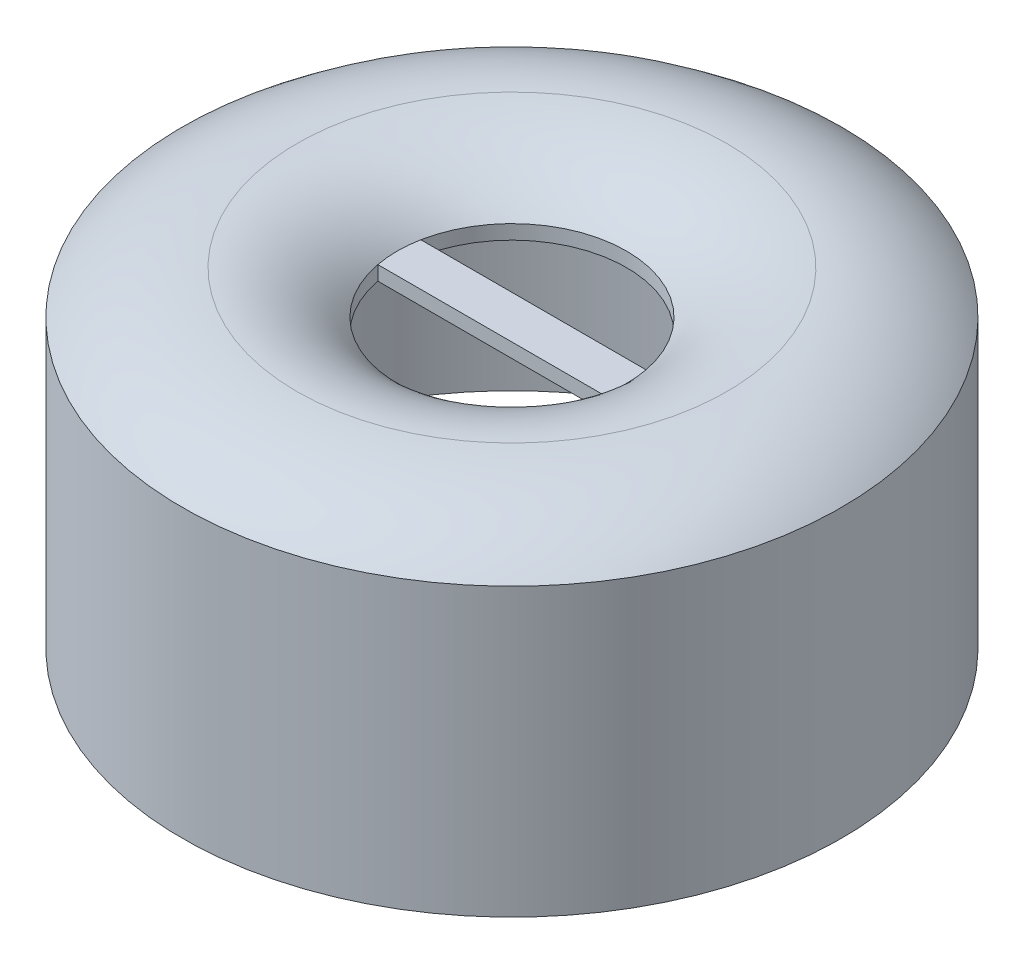
ISO-10303-21;
HEADER;
FILE_DESCRIPTION(('STEP AP214'),'2;1');
FILE_NAME('part.step','',(''),(''),'','','');
FILE_SCHEMA(('AUTOMOTIVE_DESIGN { 1 0 10303 214 1 1 1 1 }'));
ENDSEC;
DATA;
#1=APPLICATION_CONTEXT('core data for automotive mechanical design processes');
#2=APPLICATION_PROTOCOL_DEFINITION('international standard','automotive_design',2000,#1);
#3=PRODUCT_CONTEXT('',#1,'mechanical');
#4=PRODUCT('Part','Part','',(#3));
#5=PRODUCT_RELATED_PRODUCT_CATEGORY('part','',(#4));
#6=PRODUCT_DEFINITION_FORMATION('','',#4);
#7=PRODUCT_DEFINITION_CONTEXT('part definition',#1,'design');
#8=PRODUCT_DEFINITION('design','',#6,#7);
#9=PRODUCT_DEFINITION_SHAPE('','',#8);
#10=(LENGTH_UNIT() NAMED_UNIT(*) SI_UNIT(.MILLI.,.METRE.));
#11=(NAMED_UNIT(*) PLANE_ANGLE_UNIT() SI_UNIT($,.RADIAN.));
#12=(NAMED_UNIT(*) SI_UNIT($,.STERADIAN.) SOLID_ANGLE_UNIT());
#13=UNCERTAINTY_MEASURE_WITH_UNIT(LENGTH_MEASURE(1.E-05),#10,'distance_accuracy_value','');
#14=(GEOMETRIC_REPRESENTATION_CONTEXT(3) GLOBAL_UNCERTAINTY_ASSIGNED_CONTEXT((#13)) GLOBAL_UNIT_ASSIGNED_CONTEXT((#10,
#11,#12)) REPRESENTATION_CONTEXT('',''));
#15=CARTESIAN_POINT('',(0.,0.,0.));
#16=DIRECTION('',(0.,0.,1.));
#17=DIRECTION('',(1.,0.,0.));
#18=AXIS2_PLACEMENT_3D('',#15,#16,#17);
#19=CARTESIAN_POINT('',(-11.2696793002915,9.5,0.));
#20=DIRECTION('',(0.,-1.,0.));
#21=DIRECTION('',(0.,0.,-1.));
#22=AXIS2_PLACEMENT_3D('',#19,#20,#21);
#23=PLANE('',#22);
#24=CARTESIAN_POINT('',(-11.2696793002915,9.5,0.));
#25=DIRECTION('',(0.,-1.,0.));
#26=DIRECTION('',(0.,0.,-1.));
#27=AXIS2_PLACEMENT_3D('',#24,#25,#26);
#28=CIRCLE('',#27,4.);
#29=CARTESIAN_POINT('',(-7.34062088891612,9.5,-0.75));
#30=VERTEX_POINT('',#29);
#31=CARTESIAN_POINT('',(-15.198737711667,9.5,-0.75));
#32=VERTEX_POINT('',#31);
#33=EDGE_CURVE('E62',#30,#32,#28,.F.);
#34=ORIENTED_EDGE('',*,*,#33,.T.);
#35=DIRECTION('',(1.,0.,0.));
#36=VECTOR('',#35,1.);
#37=CARTESIAN_POINT('',(-15.198737711667,9.5,-0.75));
#38=LINE('',#37,#36);
#39=EDGE_CURVE('E95',#32,#30,#38,.T.);
#40=ORIENTED_EDGE('',*,*,#39,.T.);
#41=EDGE_LOOP('',(#34,#40));
#42=FACE_BOUND('',#41,.T.);
#43=CARTESIAN_POINT('',(-11.2696793002915,9.5,0.));
#44=DIRECTION('',(0.,-1.,0.));
#45=DIRECTION('',(0.,0.,-1.));
#46=AXIS2_PLACEMENT_3D('',#43,#44,#45);
#47=CIRCLE('',#46,4.);
#48=CARTESIAN_POINT('',(-15.198737711667,9.5,0.75));
#49=VERTEX_POINT('',#48);
#50=CARTESIAN_POINT('',(-7.34062088891611,9.5,0.75));
#51=VERTEX_POINT('',#50);
#52=EDGE_CURVE('E68',#49,#51,#47,.F.);
#53=ORIENTED_EDGE('',*,*,#52,.T.);
#54=DIRECTION('',(-1.,0.,0.));
#55=VECTOR('',#54,1.);
#56=CARTESIAN_POINT('',(-15.198737711667,9.5,0.75));
#57=LINE('',#56,#55);
#58=EDGE_CURVE('E13',#51,#49,#57,.T.);
#59=ORIENTED_EDGE('',*,*,#58,.T.);
#60=EDGE_LOOP('',(#53,#59));
#61=FACE_BOUND('',#60,.T.);
#62=CARTESIAN_POINT('',(-11.2696793002915,9.5,0.));
#63=DIRECTION('',(0.,-1.,0.));
#64=DIRECTION('',(0.,0.,-1.));
#65=AXIS2_PLACEMENT_3D('',#62,#63,#64);
#66=CIRCLE('',#65,5.);
#67=CARTESIAN_POINT('',(-11.2696793002915,9.5,-5.));
#68=VERTEX_POINT('',#67);
#69=EDGE_CURVE('E165',#68,#68,#66,.F.);
#70=ORIENTED_EDGE('',*,*,#69,.F.);
#71=EDGE_LOOP('',(#70));
#72=FACE_BOUND('',#71,.T.);
#73=ADVANCED_FACE('F48',(#42,#61,#72),#23,.T.);
#74=CARTESIAN_POINT('',(-11.2696793002915,0.,0.));
#75=DIRECTION('',(0.,1.,0.));
#76=DIRECTION('',(0.,0.,1.));
#77=AXIS2_PLACEMENT_3D('',#74,#75,#76);
#78=CYLINDRICAL_SURFACE('',#77,4.);
#79=ORIENTED_EDGE('',*,*,#33,.F.);
#80=DIRECTION('',(0.,1.,0.));
#81=VECTOR('',#80,1.);
#82=CARTESIAN_POINT('',(-7.34062088891611,0.,-0.75));
#83=LINE('',#82,#81);
#84=CARTESIAN_POINT('',(-7.34062088891611,10.,-0.75));
#85=VERTEX_POINT('',#84);
#86=EDGE_CURVE('E114',#30,#85,#83,.T.);
#87=ORIENTED_EDGE('',*,*,#86,.T.);
#88=CARTESIAN_POINT('',(-11.2696793002915,10.,0.));
#89=DIRECTION('',(0.,1.,0.));
#90=DIRECTION('',(0.,0.,1.));
#91=AXIS2_PLACEMENT_3D('',#88,#89,#90);
#92=CIRCLE('',#91,4.);
#93=CARTESIAN_POINT('',(-15.198737711667,10.,-0.75));
#94=VERTEX_POINT('',#93);
#95=EDGE_CURVE('E102',#85,#94,#92,.T.);
#96=ORIENTED_EDGE('',*,*,#95,.T.);
#97=DIRECTION('',(0.,1.,0.));
#98=VECTOR('',#97,1.);
#99=CARTESIAN_POINT('',(-15.198737711667,0.,-0.75));
#100=LINE('',#99,#98);
#101=EDGE_CURVE('E113',#32,#94,#100,.T.);
#102=ORIENTED_EDGE('',*,*,#101,.F.);
#103=EDGE_LOOP('',(#79,#87,#96,#102));
#104=FACE_BOUND('',#103,.T.);
#105=ADVANCED_FACE('F187',(#104),#78,.F.);
#106=CARTESIAN_POINT('',(-15.198737711667,0.,-0.75));
#107=DIRECTION('',(0.,0.,1.));
#108=DIRECTION('',(1.,0.,0.));
#109=AXIS2_PLACEMENT_3D('',#106,#107,#108);
#110=PLANE('',#109);
#111=ORIENTED_EDGE('',*,*,#39,.F.);
#112=ORIENTED_EDGE('',*,*,#101,.T.);
#113=DIRECTION('',(1.,0.,0.));
#114=VECTOR('',#113,1.);
#115=CARTESIAN_POINT('',(-15.198737711667,10.,-0.75));
#116=LINE('',#115,#114);
#117=EDGE_CURVE('E105',#94,#85,#116,.T.);
#118=ORIENTED_EDGE('',*,*,#117,.T.);
#119=ORIENTED_EDGE('',*,*,#86,.F.);
#120=EDGE_LOOP('',(#111,#112,#118,#119));
#121=FACE_BOUND('',#120,.T.);
#122=ADVANCED_FACE('F193',(#121),#110,.F.);
#123=CARTESIAN_POINT('',(-11.2696793002915,0.,0.));
#124=DIRECTION('',(0.,1.,0.));
#125=DIRECTION('',(0.,0.,1.));
#126=AXIS2_PLACEMENT_3D('',#123,#124,#125);
#127=CYLINDRICAL_SURFACE('',#126,4.);
#128=ORIENTED_EDGE('',*,*,#52,.F.);
#129=DIRECTION('',(0.,1.,0.));
#130=VECTOR('',#129,1.);
#131=CARTESIAN_POINT('',(-15.198737711667,0.,0.75));
#132=LINE('',#131,#130);
#133=CARTESIAN_POINT('',(-15.198737711667,10.,0.75));
#134=VERTEX_POINT('',#133);
#135=EDGE_CURVE('E92',#49,#134,#132,.T.);
#136=ORIENTED_EDGE('',*,*,#135,.T.);
#137=CARTESIAN_POINT('',(-11.2696793002915,10.,0.));
#138=DIRECTION('',(0.,1.,0.));
#139=DIRECTION('',(0.,0.,1.));
#140=AXIS2_PLACEMENT_3D('',#137,#138,#139);
#141=CIRCLE('',#140,4.);
#142=CARTESIAN_POINT('',(-7.34062088891612,10.,0.75));
#143=VERTEX_POINT('',#142);
#144=EDGE_CURVE('E150',#134,#143,#141,.T.);
#145=ORIENTED_EDGE('',*,*,#144,.T.);
#146=DIRECTION('',(0.,1.,0.));
#147=VECTOR('',#146,1.);
#148=CARTESIAN_POINT('',(-7.34062088891611,0.,0.75));
#149=LINE('',#148,#147);
#150=EDGE_CURVE('E94',#51,#143,#149,.T.);
#151=ORIENTED_EDGE('',*,*,#150,.F.);
#152=EDGE_LOOP('',(#128,#136,#145,#151));
#153=FACE_BOUND('',#152,.T.);
#154=ADVANCED_FACE('F90',(#153),#127,.F.);
#155=CARTESIAN_POINT('',(-15.198737711667,0.,0.75));
#156=DIRECTION('',(0.,0.,-1.));
#157=DIRECTION('',(-1.,0.,0.));
#158=AXIS2_PLACEMENT_3D('',#155,#156,#157);
#159=PLANE('',#158);
#160=ORIENTED_EDGE('',*,*,#58,.F.);
#161=ORIENTED_EDGE('',*,*,#150,.T.);
#162=DIRECTION('',(-1.,0.,0.));
#163=VECTOR('',#162,1.);
#164=CARTESIAN_POINT('',(-15.198737711667,10.,0.75));
#165=LINE('',#164,#163);
#166=EDGE_CURVE('E100',#143,#134,#165,.T.);
#167=ORIENTED_EDGE('',*,*,#166,.T.);
#168=ORIENTED_EDGE('',*,*,#135,.F.);
#169=EDGE_LOOP('',(#160,#161,#167,#168));
#170=FACE_BOUND('',#169,.T.);
#171=ADVANCED_FACE('F98',(#170),#159,.F.);
#172=CARTESIAN_POINT('',(-22.7696793002915,0.,0.));
#173=DIRECTION('',(0.,1.,0.));
#174=DIRECTION('',(0.,0.,1.));
#175=AXIS2_PLACEMENT_3D('',#172,#173,#174);
#176=PLANE('',#175);
#177=CARTESIAN_POINT('',(-11.2696793002915,0.,0.));
#178=DIRECTION('',(0.,-1.,0.));
#179=DIRECTION('',(0.,0.,-1.));
#180=AXIS2_PLACEMENT_3D('',#177,#178,#179);
#181=CIRCLE('',#180,11.);
#182=CARTESIAN_POINT('',(-11.2696793002915,0.,-11.));
#183=VERTEX_POINT('',#182);
#184=EDGE_CURVE('E156',#183,#183,#181,.T.);
#185=ORIENTED_EDGE('',*,*,#184,.F.);
#186=EDGE_LOOP('',(#185));
#187=FACE_BOUND('',#186,.T.);
#188=CARTESIAN_POINT('',(-11.2696793002915,0.,0.));
#189=DIRECTION('',(0.,-1.,0.));
#190=DIRECTION('',(0.,0.,-1.));
#191=AXIS2_PLACEMENT_3D('',#188,#189,#190);
#192=CIRCLE('',#191,11.5);
#193=CARTESIAN_POINT('',(-11.2696793002915,0.,-11.5));
#194=VERTEX_POINT('',#193);
#195=EDGE_CURVE('E56',#194,#194,#192,.T.);
#196=ORIENTED_EDGE('',*,*,#195,.T.);
#197=EDGE_LOOP('',(#196));
#198=FACE_BOUND('',#197,.T.);
#199=ADVANCED_FACE('F50',(#187,#198),#176,.F.);
#200=CARTESIAN_POINT('',(-11.2696793002915,0.,0.));
#201=DIRECTION('',(0.,-1.,0.));
#202=DIRECTION('',(0.,0.,-1.));
#203=AXIS2_PLACEMENT_3D('',#200,#201,#202);
#204=CYLINDRICAL_SURFACE('',#203,11.5);
#205=ORIENTED_EDGE('',*,*,#195,.F.);
#206=EDGE_LOOP('',(#205));
#207=FACE_BOUND('',#206,.T.);
#208=CARTESIAN_POINT('',(-11.2696793002915,10.,0.));
#209=DIRECTION('',(0.,-1.,0.));
#210=DIRECTION('',(0.,0.,-1.));
#211=AXIS2_PLACEMENT_3D('',#208,#209,#210);
#212=CIRCLE('',#211,11.5);
#213=CARTESIAN_POINT('',(-11.2696793002915,10.,-11.5));
#214=VERTEX_POINT('',#213);
#215=EDGE_CURVE('E124',#214,#214,#212,.T.);
#216=ORIENTED_EDGE('',*,*,#215,.T.);
#217=EDGE_LOOP('',(#216));
#218=FACE_BOUND('',#217,.T.);
#219=ADVANCED_FACE('F130',(#207,#218),#204,.T.);
#220=CARTESIAN_POINT('',(-11.2696793002915,5.41666666666666,0.));
#221=DIRECTION('',(0.,-1.,0.));
#222=DIRECTION('',(0.,0.,-1.));
#223=AXIS2_PLACEMENT_3D('',#220,#221,#222);
#224=TOROIDAL_SURFACE('',#223,7.5,6.08333333333334);
#225=ORIENTED_EDGE('',*,*,#215,.F.);
#226=EDGE_LOOP('',(#225));
#227=FACE_BOUND('',#226,.T.);
#228=CARTESIAN_POINT('',(-11.2696793002915,11.5,0.));
#229=DIRECTION('',(0.,-1.,0.));
#230=DIRECTION('',(0.,0.,-1.));
#231=AXIS2_PLACEMENT_3D('',#228,#229,#230);
#232=CIRCLE('',#231,7.5);
#233=CARTESIAN_POINT('',(-11.2696793002915,11.5,-7.5));
#234=VERTEX_POINT('',#233);
#235=EDGE_CURVE('E121',#234,#234,#232,.T.);
#236=ORIENTED_EDGE('',*,*,#235,.T.);
#237=EDGE_LOOP('',(#236));
#238=FACE_BOUND('',#237,.T.);
#239=ADVANCED_FACE('F133',(#227,#238),#224,.T.);
#240=CARTESIAN_POINT('',(-11.2696793002915,6.66666666666667,0.));
#241=DIRECTION('',(0.,-1.,0.));
#242=DIRECTION('',(0.,0.,-1.));
#243=AXIS2_PLACEMENT_3D('',#240,#241,#242);
#244=TOROIDAL_SURFACE('',#243,7.5,4.83333333333334);
#245=ORIENTED_EDGE('',*,*,#235,.F.);
#246=EDGE_LOOP('',(#245));
#247=FACE_BOUND('',#246,.T.);
#248=CARTESIAN_POINT('',(-11.2696793002915,10.,0.));
#249=DIRECTION('',(0.,-1.,0.));
#250=DIRECTION('',(0.,0.,-1.));
#251=AXIS2_PLACEMENT_3D('',#248,#249,#250);
#252=CIRCLE('',#251,4.);
#253=EDGE_CURVE('E118',#85,#143,#252,.T.);
#254=ORIENTED_EDGE('',*,*,#253,.T.);
#255=ORIENTED_EDGE('',*,*,#144,.F.);
#256=EDGE_CURVE('E116',#134,#94,#252,.T.);
#257=ORIENTED_EDGE('',*,*,#256,.T.);
#258=ORIENTED_EDGE('',*,*,#95,.F.);
#259=EDGE_LOOP('',(#254,#255,#257,#258));
#260=FACE_BOUND('',#259,.T.);
#261=ADVANCED_FACE('F138',(#247,#260),#244,.T.);
#262=CARTESIAN_POINT('',(-15.2696793002915,10.,0.));
#263=DIRECTION('',(0.,-1.,0.));
#264=DIRECTION('',(0.,0.,-1.));
#265=AXIS2_PLACEMENT_3D('',#262,#263,#264);
#266=PLANE('',#265);
#267=ORIENTED_EDGE('',*,*,#256,.F.);
#268=ORIENTED_EDGE('',*,*,#166,.F.);
#269=ORIENTED_EDGE('',*,*,#253,.F.);
#270=ORIENTED_EDGE('',*,*,#117,.F.);
#271=EDGE_LOOP('',(#267,#268,#269,#270));
#272=FACE_BOUND('',#271,.T.);
#273=ADVANCED_FACE('F144',(#272),#266,.F.);
#274=CARTESIAN_POINT('',(-11.2696793002915,9.5,0.));
#275=DIRECTION('',(0.,-1.,0.));
#276=DIRECTION('',(0.,0.,-1.));
#277=AXIS2_PLACEMENT_3D('',#274,#275,#276);
#278=CIRCLE('',#277,10.5);
#279=CARTESIAN_POINT('',(-11.2696793002915,9.5,-10.5));
#280=VERTEX_POINT('',#279);
#281=EDGE_CURVE('E159',#280,#280,#278,.F.);
#282=ORIENTED_EDGE('',*,*,#281,.T.);
#283=EDGE_LOOP('',(#282));
#284=FACE_BOUND('',#283,.T.);
#285=CARTESIAN_POINT('',(-11.2696793002915,9.5,0.));
#286=DIRECTION('',(0.,-1.,0.));
#287=DIRECTION('',(0.,0.,-1.));
#288=AXIS2_PLACEMENT_3D('',#285,#286,#287);
#289=CIRCLE('',#288,11.);
#290=CARTESIAN_POINT('',(-11.2696793002915,9.5,-11.));
#291=VERTEX_POINT('',#290);
#292=EDGE_CURVE('E96',#291,#291,#289,.T.);
#293=ORIENTED_EDGE('',*,*,#292,.T.);
#294=EDGE_LOOP('',(#293));
#295=FACE_BOUND('',#294,.T.);
#296=ADVANCED_FACE('F189',(#284,#295),#23,.T.);
#297=CARTESIAN_POINT('',(-11.2696793002915,9.5,0.));
#298=DIRECTION('',(0.,-1.,0.));
#299=DIRECTION('',(0.,0.,-1.));
#300=AXIS2_PLACEMENT_3D('',#297,#298,#299);
#301=CYLINDRICAL_SURFACE('',#300,11.);
#302=ORIENTED_EDGE('',*,*,#292,.F.);
#303=EDGE_LOOP('',(#302));
#304=FACE_BOUND('',#303,.T.);
#305=ORIENTED_EDGE('',*,*,#184,.T.);
#306=EDGE_LOOP('',(#305));
#307=FACE_BOUND('',#306,.T.);
#308=ADVANCED_FACE('F199',(#304,#307),#301,.F.);
#309=CARTESIAN_POINT('',(-11.2696793002915,0.,0.));
#310=DIRECTION('',(0.,-1.,0.));
#311=DIRECTION('',(0.,0.,-1.));
#312=AXIS2_PLACEMENT_3D('',#309,#310,#311);
#313=CYLINDRICAL_SURFACE('',#312,10.5);
#314=CARTESIAN_POINT('',(-11.2696793002915,9.52035741741504,0.));
#315=DIRECTION('',(0.,-1.,0.));
#316=DIRECTION('',(0.,0.,-1.));
#317=AXIS2_PLACEMENT_3D('',#314,#315,#316);
#318=CIRCLE('',#317,10.5);
#319=CARTESIAN_POINT('',(-11.2696793002915,9.52035741741504,-10.5));
#320=VERTEX_POINT('',#319);
#321=EDGE_CURVE('E164',#320,#320,#318,.T.);
#322=ORIENTED_EDGE('',*,*,#321,.F.);
#323=EDGE_LOOP('',(#322));
#324=FACE_BOUND('',#323,.T.);
#325=ORIENTED_EDGE('',*,*,#281,.F.);
#326=EDGE_LOOP('',(#325));
#327=FACE_BOUND('',#326,.T.);
#328=ADVANCED_FACE('F183',(#324,#327),#313,.F.);
#329=CARTESIAN_POINT('',(-11.2696793002915,0.,0.));
#330=DIRECTION('',(0.,1.,0.));
#331=DIRECTION('',(0.,0.,1.));
#332=AXIS2_PLACEMENT_3D('',#329,#330,#331);
#333=CYLINDRICAL_SURFACE('',#332,5.);
#334=CARTESIAN_POINT('',(-11.2696793002915,9.57259929569378,0.));
#335=DIRECTION('',(0.,-1.,0.));
#336=DIRECTION('',(0.,0.,-1.));
#337=AXIS2_PLACEMENT_3D('',#334,#335,#336);
#338=CIRCLE('',#337,5.);
#339=CARTESIAN_POINT('',(-11.2696793002915,9.57259929569378,-5.));
#340=VERTEX_POINT('',#339);
#341=EDGE_CURVE('E168',#340,#340,#338,.F.);
#342=ORIENTED_EDGE('',*,*,#341,.F.);
#343=EDGE_LOOP('',(#342));
#344=FACE_BOUND('',#343,.T.);
#345=ORIENTED_EDGE('',*,*,#69,.T.);
#346=EDGE_LOOP('',(#345));
#347=FACE_BOUND('',#346,.T.);
#348=ADVANCED_FACE('F179',(#344,#347),#333,.T.);
#349=CARTESIAN_POINT('',(-11.2696793002915,5.41666666666666,0.));
#350=DIRECTION('',(0.,-1.,0.));
#351=DIRECTION('',(0.,0.,-1.));
#352=AXIS2_PLACEMENT_3D('',#349,#350,#351);
#353=TOROIDAL_SURFACE('',#352,7.5,5.08333333333334);
#354=ORIENTED_EDGE('',*,*,#321,.T.);
#355=EDGE_LOOP('',(#354));
#356=FACE_BOUND('',#355,.T.);
#357=CARTESIAN_POINT('',(-11.2696793002915,10.5,0.));
#358=DIRECTION('',(0.,-1.,0.));
#359=DIRECTION('',(0.,0.,-1.));
#360=AXIS2_PLACEMENT_3D('',#357,#358,#359);
#361=CIRCLE('',#360,7.5);
#362=CARTESIAN_POINT('',(-11.2696793002915,10.5,-7.5));
#363=VERTEX_POINT('',#362);
#364=EDGE_CURVE('E171',#363,#363,#361,.T.);
#365=ORIENTED_EDGE('',*,*,#364,.F.);
#366=EDGE_LOOP('',(#365));
#367=FACE_BOUND('',#366,.T.);
#368=ADVANCED_FACE('F182',(#356,#367),#353,.F.);
#369=CARTESIAN_POINT('',(-11.2696793002915,6.66666666666667,0.));
#370=DIRECTION('',(0.,-1.,0.));
#371=DIRECTION('',(0.,0.,-1.));
#372=AXIS2_PLACEMENT_3D('',#369,#370,#371);
#373=TOROIDAL_SURFACE('',#372,7.5,3.83333333333334);
#374=ORIENTED_EDGE('',*,*,#364,.T.);
#375=EDGE_LOOP('',(#374));
#376=FACE_BOUND('',#375,.T.);
#377=ORIENTED_EDGE('',*,*,#341,.T.);
#378=EDGE_LOOP('',(#377));
#379=FACE_BOUND('',#378,.T.);
#380=ADVANCED_FACE('F177',(#376,#379),#373,.F.);
#381=CLOSED_SHELL('',(#73,#105,#122,#154,#171,#199,#219,#239,#261,#273,#296,#308,#328,#348,#368,#380));
#382=MANIFOLD_SOLID_BREP('B2',#381);
#383=ADVANCED_BREP_SHAPE_REPRESENTATION('',(#18,#382),#14);
#384=SHAPE_DEFINITION_REPRESENTATION(#9,#383);
ENDSEC;
END-ISO-10303-21;
